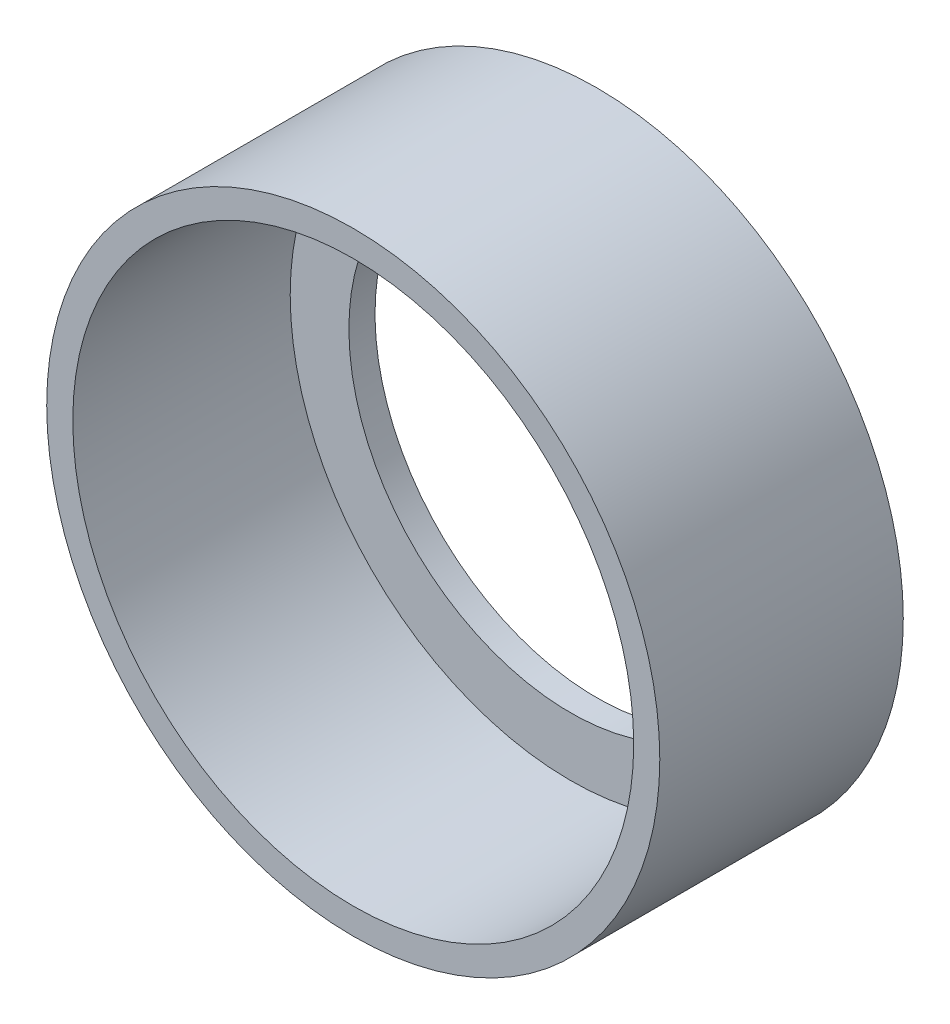
ISO-10303-21;
HEADER;
FILE_DESCRIPTION(('STEP AP214'),'2;1');
FILE_NAME('part.step','',(''),(''),'','','');
FILE_SCHEMA(('AUTOMOTIVE_DESIGN { 1 0 10303 214 1 1 1 1 }'));
ENDSEC;
DATA;
#1=APPLICATION_CONTEXT('core data for automotive mechanical design processes');
#2=APPLICATION_PROTOCOL_DEFINITION('international standard','automotive_design',2000,#1);
#3=PRODUCT_CONTEXT('',#1,'mechanical');
#4=PRODUCT('Part','Part','',(#3));
#5=PRODUCT_RELATED_PRODUCT_CATEGORY('part','',(#4));
#6=PRODUCT_DEFINITION_FORMATION('','',#4);
#7=PRODUCT_DEFINITION_CONTEXT('part definition',#1,'design');
#8=PRODUCT_DEFINITION('design','',#6,#7);
#9=PRODUCT_DEFINITION_SHAPE('','',#8);
#10=(LENGTH_UNIT() NAMED_UNIT(*) SI_UNIT(.MILLI.,.METRE.));
#11=(NAMED_UNIT(*) PLANE_ANGLE_UNIT() SI_UNIT($,.RADIAN.));
#12=(NAMED_UNIT(*) SI_UNIT($,.STERADIAN.) SOLID_ANGLE_UNIT());
#13=UNCERTAINTY_MEASURE_WITH_UNIT(LENGTH_MEASURE(1.E-05),#10,'distance_accuracy_value','');
#14=(GEOMETRIC_REPRESENTATION_CONTEXT(3) GLOBAL_UNCERTAINTY_ASSIGNED_CONTEXT((#13)) GLOBAL_UNIT_ASSIGNED_CONTEXT((#10,
#11,#12)) REPRESENTATION_CONTEXT('',''));
#15=CARTESIAN_POINT('',(0.,0.,0.));
#16=DIRECTION('',(0.,0.,1.));
#17=DIRECTION('',(1.,0.,0.));
#18=AXIS2_PLACEMENT_3D('',#15,#16,#17);
#19=CARTESIAN_POINT('',(0.,0.,-10.1790081681878));
#20=DIRECTION('',(0.,0.,-1.));
#21=DIRECTION('',(-1.,0.,0.));
#22=AXIS2_PLACEMENT_3D('',#19,#20,#21);
#23=CYLINDRICAL_SURFACE('',#22,16.383);
#24=CARTESIAN_POINT('',(0.,0.,-5.42563780231537));
#25=DIRECTION('',(0.,0.,-1.));
#26=DIRECTION('',(-1.,0.,0.));
#27=AXIS2_PLACEMENT_3D('',#24,#25,#26);
#28=CIRCLE('',#27,16.383);
#29=CARTESIAN_POINT('',(-16.383,0.,-5.42563780231537));
#30=VERTEX_POINT('',#29);
#31=EDGE_CURVE('E129',#30,#30,#28,.T.);
#32=ORIENTED_EDGE('',*,*,#31,.F.);
#33=EDGE_LOOP('',(#32));
#34=FACE_BOUND('',#33,.T.);
#35=CARTESIAN_POINT('',(0.,0.,-18.1256378023154));
#36=DIRECTION('',(0.,0.,-1.));
#37=DIRECTION('',(-1.,0.,0.));
#38=AXIS2_PLACEMENT_3D('',#35,#36,#37);
#39=CIRCLE('',#38,16.383);
#40=CARTESIAN_POINT('',(4.8895,15.6363511968106,-18.1256378023154));
#41=VERTEX_POINT('',#40);
#42=CARTESIAN_POINT('',(-4.8895,15.6363511968106,-18.1256378023154));
#43=VERTEX_POINT('',#42);
#44=EDGE_CURVE('E112',#41,#43,#39,.T.);
#45=ORIENTED_EDGE('',*,*,#44,.T.);
#46=DIRECTION('',(0.,0.,-1.));
#47=VECTOR('',#46,1.);
#48=CARTESIAN_POINT('',(-4.8895,15.6363511968106,-5.42563780231537));
#49=LINE('',#48,#47);
#50=CARTESIAN_POINT('',(-4.8895,15.6363511968106,-19.6496378023154));
#51=VERTEX_POINT('',#50);
#52=EDGE_CURVE('E85',#43,#51,#49,.T.);
#53=ORIENTED_EDGE('',*,*,#52,.T.);
#54=CARTESIAN_POINT('',(0.,0.,-19.6496378023154));
#55=DIRECTION('',(0.,0.,-1.));
#56=DIRECTION('',(1.,0.,0.));
#57=AXIS2_PLACEMENT_3D('',#54,#55,#56);
#58=CIRCLE('',#57,16.383);
#59=CARTESIAN_POINT('',(4.8895,15.6363511968106,-19.6496378023154));
#60=VERTEX_POINT('',#59);
#61=EDGE_CURVE('E89',#51,#60,#58,.T.);
#62=ORIENTED_EDGE('',*,*,#61,.T.);
#63=DIRECTION('',(0.,0.,-1.));
#64=VECTOR('',#63,1.);
#65=CARTESIAN_POINT('',(4.8895,15.6363511968106,-5.42563780231537));
#66=LINE('',#65,#64);
#67=EDGE_CURVE('E76',#41,#60,#66,.T.);
#68=ORIENTED_EDGE('',*,*,#67,.F.);
#69=EDGE_LOOP('',(#45,#53,#62,#68));
#70=FACE_BOUND('',#69,.T.);
#71=ADVANCED_FACE('F39',(#34,#70),#23,.F.);
#72=CARTESIAN_POINT('',(16.383,0.,-5.42563780231537));
#73=DIRECTION('',(0.,0.,-1.));
#74=DIRECTION('',(-1.,0.,0.));
#75=AXIS2_PLACEMENT_3D('',#72,#73,#74);
#76=PLANE('',#75);
#77=CARTESIAN_POINT('',(0.,0.,-5.42563780231538));
#78=DIRECTION('',(0.,0.,-1.));
#79=DIRECTION('',(-1.,0.,0.));
#80=AXIS2_PLACEMENT_3D('',#77,#78,#79);
#81=CIRCLE('',#80,17.907);
#82=CARTESIAN_POINT('',(-17.907,0.,-5.42563780231538));
#83=VERTEX_POINT('',#82);
#84=EDGE_CURVE('E125',#83,#83,#81,.T.);
#85=ORIENTED_EDGE('',*,*,#84,.F.);
#86=EDGE_LOOP('',(#85));
#87=FACE_BOUND('',#86,.T.);
#88=ORIENTED_EDGE('',*,*,#31,.T.);
#89=EDGE_LOOP('',(#88));
#90=FACE_BOUND('',#89,.T.);
#91=ADVANCED_FACE('F148',(#87,#90),#76,.F.);
#92=CARTESIAN_POINT('',(0.,0.,-10.1790081681878));
#93=DIRECTION('',(0.,0.,-1.));
#94=DIRECTION('',(-1.,0.,0.));
#95=AXIS2_PLACEMENT_3D('',#92,#93,#94);
#96=CYLINDRICAL_SURFACE('',#95,17.907);
#97=CARTESIAN_POINT('',(0.,0.,-19.6496378023154));
#98=DIRECTION('',(0.,0.,-1.));
#99=DIRECTION('',(-1.,0.,0.));
#100=AXIS2_PLACEMENT_3D('',#97,#98,#99);
#101=CIRCLE('',#100,17.907);
#102=CARTESIAN_POINT('',(-17.907,0.,-19.6496378023154));
#103=VERTEX_POINT('',#102);
#104=EDGE_CURVE('E121',#103,#103,#101,.T.);
#105=ORIENTED_EDGE('',*,*,#104,.F.);
#106=EDGE_LOOP('',(#105));
#107=FACE_BOUND('',#106,.T.);
#108=ORIENTED_EDGE('',*,*,#84,.T.);
#109=EDGE_LOOP('',(#108));
#110=FACE_BOUND('',#109,.T.);
#111=ADVANCED_FACE('F153',(#107,#110),#96,.T.);
#112=CARTESIAN_POINT('',(17.907,0.,-19.6496378023154));
#113=DIRECTION('',(0.,0.,1.));
#114=DIRECTION('',(1.,0.,0.));
#115=AXIS2_PLACEMENT_3D('',#112,#113,#114);
#116=PLANE('',#115);
#117=ORIENTED_EDGE('',*,*,#61,.F.);
#118=DIRECTION('',(0.,1.,0.));
#119=VECTOR('',#118,1.);
#120=CARTESIAN_POINT('',(-4.8895,15.6363511968106,-19.6496378023154));
#121=LINE('',#120,#119);
#122=CARTESIAN_POINT('',(-4.8895,11.9957870000263,-19.6496378023154));
#123=VERTEX_POINT('',#122);
#124=EDGE_CURVE('E86',#123,#51,#121,.T.);
#125=ORIENTED_EDGE('',*,*,#124,.F.);
#126=CARTESIAN_POINT('',(0.,0.,-19.6496378023154));
#127=DIRECTION('',(0.,0.,-1.));
#128=DIRECTION('',(-1.,0.,0.));
#129=AXIS2_PLACEMENT_3D('',#126,#127,#128);
#130=CIRCLE('',#129,12.954);
#131=CARTESIAN_POINT('',(4.8895,11.9957870000263,-19.6496378023154));
#132=VERTEX_POINT('',#131);
#133=EDGE_CURVE('E99',#132,#123,#130,.T.);
#134=ORIENTED_EDGE('',*,*,#133,.F.);
#135=DIRECTION('',(0.,-1.,0.));
#136=VECTOR('',#135,1.);
#137=CARTESIAN_POINT('',(4.8895,15.6363511968106,-19.6496378023154));
#138=LINE('',#137,#136);
#139=EDGE_CURVE('E80',#60,#132,#138,.T.);
#140=ORIENTED_EDGE('',*,*,#139,.F.);
#141=EDGE_LOOP('',(#117,#125,#134,#140));
#142=FACE_BOUND('',#141,.T.);
#143=ORIENTED_EDGE('',*,*,#104,.T.);
#144=EDGE_LOOP('',(#143));
#145=FACE_BOUND('',#144,.T.);
#146=ADVANCED_FACE('F96',(#142,#145),#116,.F.);
#147=CARTESIAN_POINT('',(0.,0.,-10.1790081681878));
#148=DIRECTION('',(0.,0.,-1.));
#149=DIRECTION('',(-1.,0.,0.));
#150=AXIS2_PLACEMENT_3D('',#147,#148,#149);
#151=CYLINDRICAL_SURFACE('',#150,12.954);
#152=ORIENTED_EDGE('',*,*,#133,.T.);
#153=DIRECTION('',(0.,0.,-1.));
#154=VECTOR('',#153,1.);
#155=CARTESIAN_POINT('',(-4.8895,11.9957870000263,-10.1790081681878));
#156=LINE('',#155,#154);
#157=CARTESIAN_POINT('',(-4.8895,11.9957870000263,-18.1256378023154));
#158=VERTEX_POINT('',#157);
#159=EDGE_CURVE('E109',#123,#158,#156,.F.);
#160=ORIENTED_EDGE('',*,*,#159,.T.);
#161=CARTESIAN_POINT('',(0.,0.,-18.1256378023154));
#162=DIRECTION('',(0.,0.,-1.));
#163=DIRECTION('',(-1.,0.,0.));
#164=AXIS2_PLACEMENT_3D('',#161,#162,#163);
#165=CIRCLE('',#164,12.954);
#166=CARTESIAN_POINT('',(4.8895,11.9957870000263,-18.1256378023154));
#167=VERTEX_POINT('',#166);
#168=EDGE_CURVE('E115',#167,#158,#165,.T.);
#169=ORIENTED_EDGE('',*,*,#168,.F.);
#170=DIRECTION('',(0.,0.,-1.));
#171=VECTOR('',#170,1.);
#172=CARTESIAN_POINT('',(4.8895,11.9957870000263,-10.1790081681878));
#173=LINE('',#172,#171);
#174=EDGE_CURVE('E54',#167,#132,#173,.T.);
#175=ORIENTED_EDGE('',*,*,#174,.T.);
#176=EDGE_LOOP('',(#152,#160,#169,#175));
#177=FACE_BOUND('',#176,.T.);
#178=ADVANCED_FACE('F137',(#177),#151,.F.);
#179=CARTESIAN_POINT('',(12.954,0.,-18.1256378023154));
#180=DIRECTION('',(0.,0.,-1.));
#181=DIRECTION('',(-1.,0.,0.));
#182=AXIS2_PLACEMENT_3D('',#179,#180,#181);
#183=PLANE('',#182);
#184=ORIENTED_EDGE('',*,*,#168,.T.);
#185=DIRECTION('',(0.,1.,0.));
#186=VECTOR('',#185,1.);
#187=CARTESIAN_POINT('',(-4.8895,0.,-18.1256378023154));
#188=LINE('',#187,#186);
#189=EDGE_CURVE('E11',#158,#43,#188,.T.);
#190=ORIENTED_EDGE('',*,*,#189,.T.);
#191=ORIENTED_EDGE('',*,*,#44,.F.);
#192=DIRECTION('',(0.,-1.,0.));
#193=VECTOR('',#192,1.);
#194=CARTESIAN_POINT('',(4.8895,0.,-18.1256378023154));
#195=LINE('',#194,#193);
#196=EDGE_CURVE('E47',#41,#167,#195,.T.);
#197=ORIENTED_EDGE('',*,*,#196,.T.);
#198=EDGE_LOOP('',(#184,#190,#191,#197));
#199=FACE_BOUND('',#198,.T.);
#200=ADVANCED_FACE('F135',(#199),#183,.F.);
#201=CARTESIAN_POINT('',(-4.8895,15.6363511968106,-5.42563780231537));
#202=DIRECTION('',(-1.,0.,0.));
#203=DIRECTION('',(0.,-1.,0.));
#204=AXIS2_PLACEMENT_3D('',#201,#202,#203);
#205=PLANE('',#204);
#206=ORIENTED_EDGE('',*,*,#124,.T.);
#207=ORIENTED_EDGE('',*,*,#52,.F.);
#208=ORIENTED_EDGE('',*,*,#189,.F.);
#209=ORIENTED_EDGE('',*,*,#159,.F.);
#210=EDGE_LOOP('',(#206,#207,#208,#209));
#211=FACE_BOUND('',#210,.T.);
#212=ADVANCED_FACE('F138',(#211),#205,.F.);
#213=CARTESIAN_POINT('',(4.8895,15.6363511968106,-5.42563780231537));
#214=DIRECTION('',(1.,0.,0.));
#215=DIRECTION('',(0.,1.,0.));
#216=AXIS2_PLACEMENT_3D('',#213,#214,#215);
#217=PLANE('',#216);
#218=ORIENTED_EDGE('',*,*,#196,.F.);
#219=ORIENTED_EDGE('',*,*,#67,.T.);
#220=ORIENTED_EDGE('',*,*,#139,.T.);
#221=ORIENTED_EDGE('',*,*,#174,.F.);
#222=EDGE_LOOP('',(#218,#219,#220,#221));
#223=FACE_BOUND('',#222,.T.);
#224=ADVANCED_FACE('F78',(#223),#217,.F.);
#225=CLOSED_SHELL('',(#71,#91,#111,#146,#178,#200,#212,#224));
#226=MANIFOLD_SOLID_BREP('B2',#225);
#227=ADVANCED_BREP_SHAPE_REPRESENTATION('',(#18,#226),#14);
#228=SHAPE_DEFINITION_REPRESENTATION(#9,#227);
ENDSEC;
END-ISO-10303-21;
